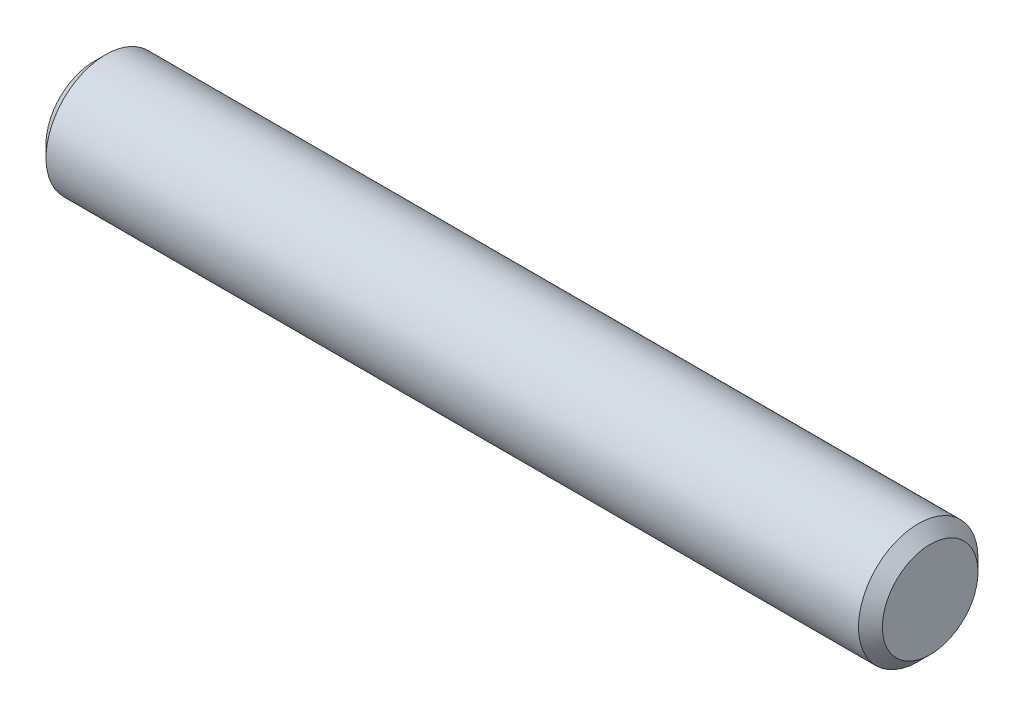
ISO-10303-21;
HEADER;
FILE_DESCRIPTION(('STEP AP214'),'2;1');
FILE_NAME('part.step','',(''),(''),'','','');
FILE_SCHEMA(('AUTOMOTIVE_DESIGN { 1 0 10303 214 1 1 1 1 }'));
ENDSEC;
DATA;
#1=APPLICATION_CONTEXT('core data for automotive mechanical design processes');
#2=APPLICATION_PROTOCOL_DEFINITION('international standard','automotive_design',2000,#1);
#3=PRODUCT_CONTEXT('',#1,'mechanical');
#4=PRODUCT('Part','Part','',(#3));
#5=PRODUCT_RELATED_PRODUCT_CATEGORY('part','',(#4));
#6=PRODUCT_DEFINITION_FORMATION('','',#4);
#7=PRODUCT_DEFINITION_CONTEXT('part definition',#1,'design');
#8=PRODUCT_DEFINITION('design','',#6,#7);
#9=PRODUCT_DEFINITION_SHAPE('','',#8);
#10=(LENGTH_UNIT() NAMED_UNIT(*) SI_UNIT(.MILLI.,.METRE.));
#11=(NAMED_UNIT(*) PLANE_ANGLE_UNIT() SI_UNIT($,.RADIAN.));
#12=(NAMED_UNIT(*) SI_UNIT($,.STERADIAN.) SOLID_ANGLE_UNIT());
#13=UNCERTAINTY_MEASURE_WITH_UNIT(LENGTH_MEASURE(1.E-05),#10,'distance_accuracy_value','');
#14=(GEOMETRIC_REPRESENTATION_CONTEXT(3) GLOBAL_UNCERTAINTY_ASSIGNED_CONTEXT((#13)) GLOBAL_UNIT_ASSIGNED_CONTEXT((#10,
#11,#12)) REPRESENTATION_CONTEXT('',''));
#15=CARTESIAN_POINT('',(0.,0.,0.));
#16=DIRECTION('',(0.,0.,1.));
#17=DIRECTION('',(1.,0.,0.));
#18=AXIS2_PLACEMENT_3D('',#15,#16,#17);
#19=CARTESIAN_POINT('',(-21.59,0.,0.));
#20=DIRECTION('',(1.,0.,0.));
#21=DIRECTION('',(0.,0.,-1.));
#22=AXIS2_PLACEMENT_3D('',#19,#20,#21);
#23=CONICAL_SURFACE('',#22,3.175,0.785398163397452);
#24=CARTESIAN_POINT('',(-22.225,0.,0.));
#25=DIRECTION('',(1.,0.,0.));
#26=DIRECTION('',(0.,0.,-1.));
#27=AXIS2_PLACEMENT_3D('',#24,#25,#26);
#28=CIRCLE('',#27,2.54);
#29=CARTESIAN_POINT('',(-22.225,0.,-2.54));
#30=VERTEX_POINT('',#29);
#31=EDGE_CURVE('E60',#30,#30,#28,.T.);
#32=ORIENTED_EDGE('',*,*,#31,.T.);
#33=EDGE_LOOP('',(#32));
#34=FACE_BOUND('',#33,.T.);
#35=CARTESIAN_POINT('',(-21.59,0.,0.));
#36=DIRECTION('',(1.,0.,0.));
#37=DIRECTION('',(0.,0.,-1.));
#38=AXIS2_PLACEMENT_3D('',#35,#36,#37);
#39=CIRCLE('',#38,3.175);
#40=CARTESIAN_POINT('',(-21.59,0.,-3.175));
#41=VERTEX_POINT('',#40);
#42=EDGE_CURVE('E10',#41,#41,#39,.T.);
#43=ORIENTED_EDGE('',*,*,#42,.F.);
#44=EDGE_LOOP('',(#43));
#45=FACE_BOUND('',#44,.T.);
#46=ADVANCED_FACE('F43',(#34,#45),#23,.T.);
#47=CARTESIAN_POINT('',(-22.225,0.,0.));
#48=DIRECTION('',(1.,0.,0.));
#49=DIRECTION('',(0.,0.,-1.));
#50=AXIS2_PLACEMENT_3D('',#47,#48,#49);
#51=CYLINDRICAL_SURFACE('',#50,3.175);
#52=ORIENTED_EDGE('',*,*,#42,.T.);
#53=EDGE_LOOP('',(#52));
#54=FACE_BOUND('',#53,.T.);
#55=CARTESIAN_POINT('',(21.59,0.,0.));
#56=DIRECTION('',(1.,0.,0.));
#57=DIRECTION('',(0.,0.,-1.));
#58=AXIS2_PLACEMENT_3D('',#55,#56,#57);
#59=CIRCLE('',#58,3.175);
#60=CARTESIAN_POINT('',(21.59,0.,-3.175));
#61=VERTEX_POINT('',#60);
#62=EDGE_CURVE('E50',#61,#61,#59,.T.);
#63=ORIENTED_EDGE('',*,*,#62,.F.);
#64=EDGE_LOOP('',(#63));
#65=FACE_BOUND('',#64,.T.);
#66=ADVANCED_FACE('F80',(#54,#65),#51,.T.);
#67=CARTESIAN_POINT('',(22.225,0.,0.));
#68=DIRECTION('',(-1.,0.,0.));
#69=DIRECTION('',(0.,0.,1.));
#70=AXIS2_PLACEMENT_3D('',#67,#68,#69);
#71=CONICAL_SURFACE('',#70,2.54,0.785398163397452);
#72=ORIENTED_EDGE('',*,*,#62,.T.);
#73=EDGE_LOOP('',(#72));
#74=FACE_BOUND('',#73,.T.);
#75=CARTESIAN_POINT('',(22.225,0.,0.));
#76=DIRECTION('',(1.,0.,0.));
#77=DIRECTION('',(0.,0.,-1.));
#78=AXIS2_PLACEMENT_3D('',#75,#76,#77);
#79=CIRCLE('',#78,2.54);
#80=CARTESIAN_POINT('',(22.225,0.,-2.54));
#81=VERTEX_POINT('',#80);
#82=EDGE_CURVE('E55',#81,#81,#79,.T.);
#83=ORIENTED_EDGE('',*,*,#82,.F.);
#84=EDGE_LOOP('',(#83));
#85=FACE_BOUND('',#84,.T.);
#86=ADVANCED_FACE('F76',(#74,#85),#71,.T.);
#87=CARTESIAN_POINT('',(22.225,0.,0.));
#88=DIRECTION('',(1.,0.,0.));
#89=DIRECTION('',(0.,0.,-1.));
#90=AXIS2_PLACEMENT_3D('',#87,#88,#89);
#91=PLANE('',#90);
#92=ORIENTED_EDGE('',*,*,#82,.T.);
#93=EDGE_LOOP('',(#92));
#94=FACE_BOUND('',#93,.T.);
#95=ADVANCED_FACE('F71',(#94),#91,.T.);
#96=CARTESIAN_POINT('',(-22.225,2.54,0.));
#97=DIRECTION('',(-1.,0.,0.));
#98=DIRECTION('',(0.,0.,1.));
#99=AXIS2_PLACEMENT_3D('',#96,#97,#98);
#100=PLANE('',#99);
#101=ORIENTED_EDGE('',*,*,#31,.F.);
#102=EDGE_LOOP('',(#101));
#103=FACE_BOUND('',#102,.T.);
#104=ADVANCED_FACE('F69',(#103),#100,.T.);
#105=CLOSED_SHELL('',(#46,#66,#86,#95,#104));
#106=MANIFOLD_SOLID_BREP('B2',#105);
#107=ADVANCED_BREP_SHAPE_REPRESENTATION('',(#18,#106),#14);
#108=SHAPE_DEFINITION_REPRESENTATION(#9,#107);
ENDSEC;
END-ISO-10303-21;
